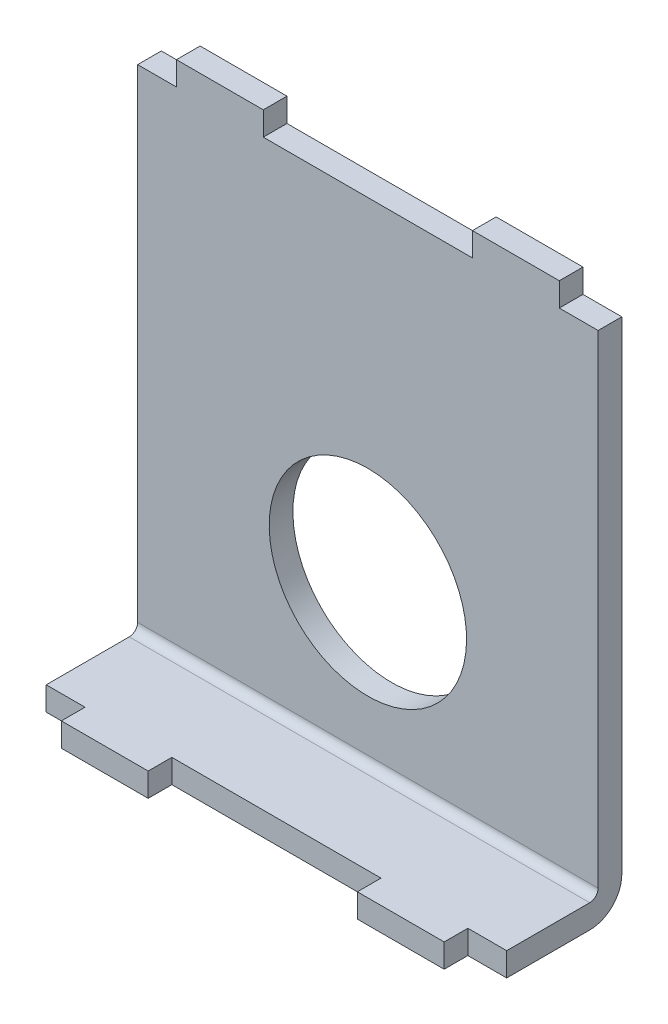
ISO-10303-21;
HEADER;
FILE_DESCRIPTION(('STEP AP214'),'2;1');
FILE_NAME('part.step','',(''),(''),'','','');
FILE_SCHEMA(('AUTOMOTIVE_DESIGN { 1 0 10303 214 1 1 1 1 }'));
ENDSEC;
DATA;
#1=APPLICATION_CONTEXT('core data for automotive mechanical design processes');
#2=APPLICATION_PROTOCOL_DEFINITION('international standard','automotive_design',2000,#1);
#3=PRODUCT_CONTEXT('',#1,'mechanical');
#4=PRODUCT('Part','Part','',(#3));
#5=PRODUCT_RELATED_PRODUCT_CATEGORY('part','',(#4));
#6=PRODUCT_DEFINITION_FORMATION('','',#4);
#7=PRODUCT_DEFINITION_CONTEXT('part definition',#1,'design');
#8=PRODUCT_DEFINITION('design','',#6,#7);
#9=PRODUCT_DEFINITION_SHAPE('','',#8);
#10=(LENGTH_UNIT() NAMED_UNIT(*) SI_UNIT(.MILLI.,.METRE.));
#11=(NAMED_UNIT(*) PLANE_ANGLE_UNIT() SI_UNIT($,.RADIAN.));
#12=(NAMED_UNIT(*) SI_UNIT($,.STERADIAN.) SOLID_ANGLE_UNIT());
#13=UNCERTAINTY_MEASURE_WITH_UNIT(LENGTH_MEASURE(1.E-05),#10,'distance_accuracy_value','');
#14=(GEOMETRIC_REPRESENTATION_CONTEXT(3) GLOBAL_UNCERTAINTY_ASSIGNED_CONTEXT((#13)) GLOBAL_UNIT_ASSIGNED_CONTEXT((#10,
#11,#12)) REPRESENTATION_CONTEXT('',''));
#15=CARTESIAN_POINT('',(0.,0.,0.));
#16=DIRECTION('',(0.,0.,1.));
#17=DIRECTION('',(1.,0.,0.));
#18=AXIS2_PLACEMENT_3D('',#15,#16,#17);
#19=CARTESIAN_POINT('',(0.,-24.86025,-1.02348685082632E-13));
#20=DIRECTION('',(0.,1.,0.));
#21=DIRECTION('',(0.,0.,1.));
#22=AXIS2_PLACEMENT_3D('',#19,#20,#21);
#23=PLANE('',#22);
#24=DIRECTION('',(0.,0.,1.));
#25=VECTOR('',#24,1.);
#26=CARTESIAN_POINT('',(22.225,-24.86025,11.1125));
#27=LINE('',#26,#25);
#28=CARTESIAN_POINT('',(22.225,-24.86025,3.09879999999998));
#29=VERTEX_POINT('',#28);
#30=CARTESIAN_POINT('',(22.225,-24.86025,11.1125));
#31=VERTEX_POINT('',#30);
#32=EDGE_CURVE('E222',#29,#31,#27,.T.);
#33=ORIENTED_EDGE('',*,*,#32,.T.);
#34=DIRECTION('',(1.,0.,0.));
#35=VECTOR('',#34,1.);
#36=CARTESIAN_POINT('',(-22.225,-24.86025,11.1125));
#37=LINE('',#36,#35);
#38=CARTESIAN_POINT('',(18.4785,-24.86025,11.1125));
#39=VERTEX_POINT('',#38);
#40=EDGE_CURVE('E255',#31,#39,#37,.F.);
#41=ORIENTED_EDGE('',*,*,#40,.T.);
#42=DIRECTION('',(0.,0.,1.));
#43=VECTOR('',#42,1.);
#44=CARTESIAN_POINT('',(18.4785,-24.86025,11.1125));
#45=LINE('',#44,#43);
#46=CARTESIAN_POINT('',(18.4785,-24.86025,13.3985));
#47=VERTEX_POINT('',#46);
#48=EDGE_CURVE('E265',#47,#39,#45,.F.);
#49=ORIENTED_EDGE('',*,*,#48,.F.);
#50=DIRECTION('',(1.,0.,0.));
#51=VECTOR('',#50,1.);
#52=CARTESIAN_POINT('',(18.4785,-24.86025,13.3985));
#53=LINE('',#52,#51);
#54=CARTESIAN_POINT('',(10.0965,-24.86025,13.3985));
#55=VERTEX_POINT('',#54);
#56=EDGE_CURVE('E274',#55,#47,#53,.T.);
#57=ORIENTED_EDGE('',*,*,#56,.F.);
#58=DIRECTION('',(0.,0.,1.));
#59=VECTOR('',#58,1.);
#60=CARTESIAN_POINT('',(10.0965,-24.86025,13.3985));
#61=LINE('',#60,#59);
#62=CARTESIAN_POINT('',(10.0965,-24.86025,11.1125));
#63=VERTEX_POINT('',#62);
#64=EDGE_CURVE('E284',#63,#55,#61,.T.);
#65=ORIENTED_EDGE('',*,*,#64,.F.);
#66=DIRECTION('',(1.,0.,0.));
#67=VECTOR('',#66,1.);
#68=CARTESIAN_POINT('',(-22.225,-24.86025,11.1125));
#69=LINE('',#68,#67);
#70=CARTESIAN_POINT('',(-10.0965,-24.86025,11.1125));
#71=VERTEX_POINT('',#70);
#72=EDGE_CURVE('E294',#63,#71,#69,.F.);
#73=ORIENTED_EDGE('',*,*,#72,.T.);
#74=DIRECTION('',(0.,0.,-1.));
#75=VECTOR('',#74,1.);
#76=CARTESIAN_POINT('',(-10.0965,-24.86025,13.3985));
#77=LINE('',#76,#75);
#78=CARTESIAN_POINT('',(-10.0965,-24.86025,13.3985));
#79=VERTEX_POINT('',#78);
#80=EDGE_CURVE('E303',#79,#71,#77,.T.);
#81=ORIENTED_EDGE('',*,*,#80,.F.);
#82=DIRECTION('',(1.,0.,0.));
#83=VECTOR('',#82,1.);
#84=CARTESIAN_POINT('',(-18.4785,-24.86025,13.3985));
#85=LINE('',#84,#83);
#86=CARTESIAN_POINT('',(-18.4785,-24.86025,13.3985));
#87=VERTEX_POINT('',#86);
#88=EDGE_CURVE('E312',#87,#79,#85,.T.);
#89=ORIENTED_EDGE('',*,*,#88,.F.);
#90=DIRECTION('',(0.,0.,1.));
#91=VECTOR('',#90,1.);
#92=CARTESIAN_POINT('',(-18.4785,-24.86025,11.1125));
#93=LINE('',#92,#91);
#94=CARTESIAN_POINT('',(-18.4785,-24.86025,11.1125));
#95=VERTEX_POINT('',#94);
#96=EDGE_CURVE('E262',#95,#87,#93,.T.);
#97=ORIENTED_EDGE('',*,*,#96,.F.);
#98=DIRECTION('',(1.,0.,0.));
#99=VECTOR('',#98,1.);
#100=CARTESIAN_POINT('',(-22.225,-24.86025,11.1125));
#101=LINE('',#100,#99);
#102=CARTESIAN_POINT('',(-22.225,-24.86025,11.1125));
#103=VERTEX_POINT('',#102);
#104=EDGE_CURVE('E260',#95,#103,#101,.F.);
#105=ORIENTED_EDGE('',*,*,#104,.T.);
#106=DIRECTION('',(0.,0.,1.));
#107=VECTOR('',#106,1.);
#108=CARTESIAN_POINT('',(-22.225,-24.86025,2.28599999999998));
#109=LINE('',#108,#107);
#110=CARTESIAN_POINT('',(-22.225,-24.86025,3.09879999999998));
#111=VERTEX_POINT('',#110);
#112=EDGE_CURVE('E225',#103,#111,#109,.F.);
#113=ORIENTED_EDGE('',*,*,#112,.T.);
#114=DIRECTION('',(1.,0.,0.));
#115=VECTOR('',#114,1.);
#116=CARTESIAN_POINT('',(22.225,-24.86025,3.09879999999998));
#117=LINE('',#116,#115);
#118=EDGE_CURVE('E182',#29,#111,#117,.F.);
#119=ORIENTED_EDGE('',*,*,#118,.F.);
#120=EDGE_LOOP('',(#33,#41,#49,#57,#65,#73,#81,#89,#97,#105,#113,#119));
#121=FACE_BOUND('',#120,.T.);
#122=ADVANCED_FACE('F18',(#121),#23,.F.);
#123=CARTESIAN_POINT('',(-22.225,-24.86025,11.1125));
#124=DIRECTION('',(0.,0.,-1.));
#125=DIRECTION('',(0.,1.,0.));
#126=AXIS2_PLACEMENT_3D('',#123,#124,#125);
#127=PLANE('',#126);
#128=DIRECTION('',(0.,-1.,0.));
#129=VECTOR('',#128,1.);
#130=CARTESIAN_POINT('',(-18.4785,-22.57425,11.1125));
#131=LINE('',#130,#129);
#132=CARTESIAN_POINT('',(-18.4785,-22.57425,11.1125));
#133=VERTEX_POINT('',#132);
#134=EDGE_CURVE('E315',#133,#95,#131,.T.);
#135=ORIENTED_EDGE('',*,*,#134,.F.);
#136=DIRECTION('',(1.,0.,0.));
#137=VECTOR('',#136,1.);
#138=CARTESIAN_POINT('',(0.,-22.57425,11.1125));
#139=LINE('',#138,#137);
#140=CARTESIAN_POINT('',(-22.225,-22.57425,11.1125));
#141=VERTEX_POINT('',#140);
#142=EDGE_CURVE('E240',#141,#133,#139,.T.);
#143=ORIENTED_EDGE('',*,*,#142,.F.);
#144=DIRECTION('',(0.,1.,0.));
#145=VECTOR('',#144,1.);
#146=CARTESIAN_POINT('',(-22.225,-24.86025,11.1125));
#147=LINE('',#146,#145);
#148=EDGE_CURVE('E232',#141,#103,#147,.F.);
#149=ORIENTED_EDGE('',*,*,#148,.T.);
#150=ORIENTED_EDGE('',*,*,#104,.F.);
#151=EDGE_LOOP('',(#135,#143,#149,#150));
#152=FACE_BOUND('',#151,.T.);
#153=ADVANCED_FACE('F387',(#152),#127,.F.);
#154=CARTESIAN_POINT('',(-18.4785,-22.57425,11.1125));
#155=DIRECTION('',(-1.,0.,0.));
#156=DIRECTION('',(0.,-1.,0.));
#157=AXIS2_PLACEMENT_3D('',#154,#155,#156);
#158=PLANE('',#157);
#159=DIRECTION('',(0.,0.,1.));
#160=VECTOR('',#159,1.);
#161=CARTESIAN_POINT('',(-18.4785,-22.57425,0.));
#162=LINE('',#161,#160);
#163=CARTESIAN_POINT('',(-18.4785,-22.57425,13.3985));
#164=VERTEX_POINT('',#163);
#165=EDGE_CURVE('E243',#133,#164,#162,.T.);
#166=ORIENTED_EDGE('',*,*,#165,.F.);
#167=ORIENTED_EDGE('',*,*,#134,.T.);
#168=ORIENTED_EDGE('',*,*,#96,.T.);
#169=DIRECTION('',(0.,-1.,0.));
#170=VECTOR('',#169,1.);
#171=CARTESIAN_POINT('',(-18.4785,-22.57425,13.3985));
#172=LINE('',#171,#170);
#173=EDGE_CURVE('E306',#164,#87,#172,.T.);
#174=ORIENTED_EDGE('',*,*,#173,.F.);
#175=EDGE_LOOP('',(#166,#167,#168,#174));
#176=FACE_BOUND('',#175,.T.);
#177=ADVANCED_FACE('F384',(#176),#158,.T.);
#178=CARTESIAN_POINT('',(-18.4785,-22.57425,13.3985));
#179=DIRECTION('',(0.,0.,1.));
#180=DIRECTION('',(0.,-1.,0.));
#181=AXIS2_PLACEMENT_3D('',#178,#179,#180);
#182=PLANE('',#181);
#183=DIRECTION('',(1.,0.,0.));
#184=VECTOR('',#183,1.);
#185=CARTESIAN_POINT('',(0.,-22.57425,13.3985));
#186=LINE('',#185,#184);
#187=CARTESIAN_POINT('',(-10.0965,-22.57425,13.3985));
#188=VERTEX_POINT('',#187);
#189=EDGE_CURVE('E380',#164,#188,#186,.T.);
#190=ORIENTED_EDGE('',*,*,#189,.F.);
#191=ORIENTED_EDGE('',*,*,#173,.T.);
#192=ORIENTED_EDGE('',*,*,#88,.T.);
#193=DIRECTION('',(0.,1.,0.));
#194=VECTOR('',#193,1.);
#195=CARTESIAN_POINT('',(-10.0965,-22.57425,13.3985));
#196=LINE('',#195,#194);
#197=EDGE_CURVE('E296',#188,#79,#196,.F.);
#198=ORIENTED_EDGE('',*,*,#197,.F.);
#199=EDGE_LOOP('',(#190,#191,#192,#198));
#200=FACE_BOUND('',#199,.T.);
#201=ADVANCED_FACE('F379',(#200),#182,.T.);
#202=CARTESIAN_POINT('',(-10.0965,-22.57425,13.3985));
#203=DIRECTION('',(1.,0.,0.));
#204=DIRECTION('',(0.,0.,-1.));
#205=AXIS2_PLACEMENT_3D('',#202,#203,#204);
#206=PLANE('',#205);
#207=DIRECTION('',(0.,0.,1.));
#208=VECTOR('',#207,1.);
#209=CARTESIAN_POINT('',(-10.0965,-22.57425,0.));
#210=LINE('',#209,#208);
#211=CARTESIAN_POINT('',(-10.0965,-22.57425,11.1125));
#212=VERTEX_POINT('',#211);
#213=EDGE_CURVE('E375',#188,#212,#210,.F.);
#214=ORIENTED_EDGE('',*,*,#213,.F.);
#215=ORIENTED_EDGE('',*,*,#197,.T.);
#216=ORIENTED_EDGE('',*,*,#80,.T.);
#217=DIRECTION('',(0.,1.,0.));
#218=VECTOR('',#217,1.);
#219=CARTESIAN_POINT('',(-10.0965,-24.86025,11.1125));
#220=LINE('',#219,#218);
#221=EDGE_CURVE('E287',#71,#212,#220,.T.);
#222=ORIENTED_EDGE('',*,*,#221,.T.);
#223=EDGE_LOOP('',(#214,#215,#216,#222));
#224=FACE_BOUND('',#223,.T.);
#225=ADVANCED_FACE('F374',(#224),#206,.T.);
#226=CARTESIAN_POINT('',(-22.225,-24.86025,11.1125));
#227=DIRECTION('',(0.,0.,-1.));
#228=DIRECTION('',(0.,1.,0.));
#229=AXIS2_PLACEMENT_3D('',#226,#227,#228);
#230=PLANE('',#229);
#231=ORIENTED_EDGE('',*,*,#221,.F.);
#232=ORIENTED_EDGE('',*,*,#72,.F.);
#233=DIRECTION('',(0.,-1.,0.));
#234=VECTOR('',#233,1.);
#235=CARTESIAN_POINT('',(10.0965,-22.57425,11.1125));
#236=LINE('',#235,#234);
#237=CARTESIAN_POINT('',(10.0965,-22.57425,11.1125));
#238=VERTEX_POINT('',#237);
#239=EDGE_CURVE('E277',#238,#63,#236,.T.);
#240=ORIENTED_EDGE('',*,*,#239,.F.);
#241=DIRECTION('',(1.,0.,0.));
#242=VECTOR('',#241,1.);
#243=CARTESIAN_POINT('',(0.,-22.57425,11.1125));
#244=LINE('',#243,#242);
#245=EDGE_CURVE('E370',#212,#238,#244,.T.);
#246=ORIENTED_EDGE('',*,*,#245,.F.);
#247=EDGE_LOOP('',(#231,#232,#240,#246));
#248=FACE_BOUND('',#247,.T.);
#249=ADVANCED_FACE('F368',(#248),#230,.F.);
#250=CARTESIAN_POINT('',(10.0965,-22.57425,13.3985));
#251=DIRECTION('',(-1.,0.,0.));
#252=DIRECTION('',(0.,-1.,0.));
#253=AXIS2_PLACEMENT_3D('',#250,#251,#252);
#254=PLANE('',#253);
#255=DIRECTION('',(0.,0.,1.));
#256=VECTOR('',#255,1.);
#257=CARTESIAN_POINT('',(10.0965,-22.57425,0.));
#258=LINE('',#257,#256);
#259=CARTESIAN_POINT('',(10.0965,-22.57425,13.3985));
#260=VERTEX_POINT('',#259);
#261=EDGE_CURVE('E363',#238,#260,#258,.T.);
#262=ORIENTED_EDGE('',*,*,#261,.F.);
#263=ORIENTED_EDGE('',*,*,#239,.T.);
#264=ORIENTED_EDGE('',*,*,#64,.T.);
#265=DIRECTION('',(0.,-1.,0.));
#266=VECTOR('',#265,1.);
#267=CARTESIAN_POINT('',(10.0965,-22.57425,13.3985));
#268=LINE('',#267,#266);
#269=EDGE_CURVE('E268',#260,#55,#268,.T.);
#270=ORIENTED_EDGE('',*,*,#269,.F.);
#271=EDGE_LOOP('',(#262,#263,#264,#270));
#272=FACE_BOUND('',#271,.T.);
#273=ADVANCED_FACE('F362',(#272),#254,.T.);
#274=CARTESIAN_POINT('',(18.4785,-22.57425,13.3985));
#275=DIRECTION('',(0.,0.,1.));
#276=DIRECTION('',(0.,-1.,0.));
#277=AXIS2_PLACEMENT_3D('',#274,#275,#276);
#278=PLANE('',#277);
#279=DIRECTION('',(1.,0.,0.));
#280=VECTOR('',#279,1.);
#281=CARTESIAN_POINT('',(0.,-22.57425,13.3985));
#282=LINE('',#281,#280);
#283=CARTESIAN_POINT('',(18.4785,-22.57425,13.3985));
#284=VERTEX_POINT('',#283);
#285=EDGE_CURVE('E358',#260,#284,#282,.T.);
#286=ORIENTED_EDGE('',*,*,#285,.F.);
#287=ORIENTED_EDGE('',*,*,#269,.T.);
#288=ORIENTED_EDGE('',*,*,#56,.T.);
#289=DIRECTION('',(0.,1.,0.));
#290=VECTOR('',#289,1.);
#291=CARTESIAN_POINT('',(18.4785,-22.57425,13.3985));
#292=LINE('',#291,#290);
#293=EDGE_CURVE('E257',#284,#47,#292,.F.);
#294=ORIENTED_EDGE('',*,*,#293,.F.);
#295=EDGE_LOOP('',(#286,#287,#288,#294));
#296=FACE_BOUND('',#295,.T.);
#297=ADVANCED_FACE('F357',(#296),#278,.T.);
#298=CARTESIAN_POINT('',(18.4785,-22.57425,11.1125));
#299=DIRECTION('',(1.,0.,0.));
#300=DIRECTION('',(0.,1.,0.));
#301=AXIS2_PLACEMENT_3D('',#298,#299,#300);
#302=PLANE('',#301);
#303=DIRECTION('',(0.,0.,1.));
#304=VECTOR('',#303,1.);
#305=CARTESIAN_POINT('',(18.4785,-22.57425,0.));
#306=LINE('',#305,#304);
#307=CARTESIAN_POINT('',(18.4785,-22.57425,11.1125));
#308=VERTEX_POINT('',#307);
#309=EDGE_CURVE('E252',#284,#308,#306,.F.);
#310=ORIENTED_EDGE('',*,*,#309,.F.);
#311=ORIENTED_EDGE('',*,*,#293,.T.);
#312=ORIENTED_EDGE('',*,*,#48,.T.);
#313=DIRECTION('',(0.,1.,0.));
#314=VECTOR('',#313,1.);
#315=CARTESIAN_POINT('',(18.4785,-24.86025,11.1125));
#316=LINE('',#315,#314);
#317=EDGE_CURVE('E237',#39,#308,#316,.T.);
#318=ORIENTED_EDGE('',*,*,#317,.T.);
#319=EDGE_LOOP('',(#310,#311,#312,#318));
#320=FACE_BOUND('',#319,.T.);
#321=ADVANCED_FACE('F353',(#320),#302,.T.);
#322=CARTESIAN_POINT('',(-22.225,-24.86025,11.1125));
#323=DIRECTION('',(0.,0.,-1.));
#324=DIRECTION('',(0.,1.,0.));
#325=AXIS2_PLACEMENT_3D('',#322,#323,#324);
#326=PLANE('',#325);
#327=ORIENTED_EDGE('',*,*,#317,.F.);
#328=ORIENTED_EDGE('',*,*,#40,.F.);
#329=DIRECTION('',(0.,-1.,0.));
#330=VECTOR('',#329,1.);
#331=CARTESIAN_POINT('',(22.225,-24.86025,11.1125));
#332=LINE('',#331,#330);
#333=CARTESIAN_POINT('',(22.225,-22.57425,11.1125));
#334=VERTEX_POINT('',#333);
#335=EDGE_CURVE('E224',#31,#334,#332,.F.);
#336=ORIENTED_EDGE('',*,*,#335,.T.);
#337=DIRECTION('',(1.,0.,0.));
#338=VECTOR('',#337,1.);
#339=CARTESIAN_POINT('',(0.,-22.57425,11.1125));
#340=LINE('',#339,#338);
#341=EDGE_CURVE('E187',#308,#334,#340,.T.);
#342=ORIENTED_EDGE('',*,*,#341,.F.);
#343=EDGE_LOOP('',(#327,#328,#336,#342));
#344=FACE_BOUND('',#343,.T.);
#345=ADVANCED_FACE('F348',(#344),#326,.F.);
#346=CARTESIAN_POINT('',(22.225,-21.76145,3.09879999999999));
#347=DIRECTION('',(1.,0.,0.));
#348=DIRECTION('',(0.,1.,0.));
#349=AXIS2_PLACEMENT_3D('',#346,#347,#348);
#350=CYLINDRICAL_SURFACE('',#349,3.0988);
#351=ORIENTED_EDGE('',*,*,#118,.T.);
#352=CARTESIAN_POINT('',(-22.225,-21.76145,3.09879999999999));
#353=DIRECTION('',(1.,0.,0.));
#354=DIRECTION('',(0.,1.,0.));
#355=AXIS2_PLACEMENT_3D('',#352,#353,#354);
#356=CIRCLE('',#355,3.0988);
#357=CARTESIAN_POINT('',(-22.225,-21.76145,0.));
#358=VERTEX_POINT('',#357);
#359=EDGE_CURVE('E21',#358,#111,#356,.F.);
#360=ORIENTED_EDGE('',*,*,#359,.F.);
#361=DIRECTION('',(1.,0.,0.));
#362=VECTOR('',#361,1.);
#363=CARTESIAN_POINT('',(-22.225,-21.76145,0.));
#364=LINE('',#363,#362);
#365=CARTESIAN_POINT('',(22.225,-21.76145,0.));
#366=VERTEX_POINT('',#365);
#367=EDGE_CURVE('E180',#358,#366,#364,.T.);
#368=ORIENTED_EDGE('',*,*,#367,.T.);
#369=CARTESIAN_POINT('',(22.225,-21.76145,3.09879999999999));
#370=DIRECTION('',(1.,0.,0.));
#371=DIRECTION('',(0.,1.,0.));
#372=AXIS2_PLACEMENT_3D('',#369,#370,#371);
#373=CIRCLE('',#372,3.0988);
#374=EDGE_CURVE('E186',#366,#29,#373,.F.);
#375=ORIENTED_EDGE('',*,*,#374,.T.);
#376=EDGE_LOOP('',(#351,#360,#368,#375));
#377=FACE_BOUND('',#376,.T.);
#378=ADVANCED_FACE('F178',(#377),#350,.T.);
#379=CARTESIAN_POINT('',(0.,-22.57425,0.));
#380=DIRECTION('',(0.,1.,0.));
#381=DIRECTION('',(0.,0.,1.));
#382=AXIS2_PLACEMENT_3D('',#379,#380,#381);
#383=PLANE('',#382);
#384=ORIENTED_EDGE('',*,*,#309,.T.);
#385=ORIENTED_EDGE('',*,*,#341,.T.);
#386=DIRECTION('',(0.,0.,1.));
#387=VECTOR('',#386,1.);
#388=CARTESIAN_POINT('',(22.225,-22.57425,0.));
#389=LINE('',#388,#387);
#390=CARTESIAN_POINT('',(22.225,-22.57425,3.09879999999998));
#391=VERTEX_POINT('',#390);
#392=EDGE_CURVE('E229',#334,#391,#389,.F.);
#393=ORIENTED_EDGE('',*,*,#392,.T.);
#394=DIRECTION('',(1.,0.,0.));
#395=VECTOR('',#394,1.);
#396=CARTESIAN_POINT('',(22.225,-22.57425,3.09879999999998));
#397=LINE('',#396,#395);
#398=CARTESIAN_POINT('',(-22.225,-22.57425,3.09879999999998));
#399=VERTEX_POINT('',#398);
#400=EDGE_CURVE('E204',#391,#399,#397,.F.);
#401=ORIENTED_EDGE('',*,*,#400,.T.);
#402=DIRECTION('',(0.,0.,1.));
#403=VECTOR('',#402,1.);
#404=CARTESIAN_POINT('',(-22.225,-22.57425,0.));
#405=LINE('',#404,#403);
#406=EDGE_CURVE('E244',#399,#141,#405,.T.);
#407=ORIENTED_EDGE('',*,*,#406,.T.);
#408=ORIENTED_EDGE('',*,*,#142,.T.);
#409=ORIENTED_EDGE('',*,*,#165,.T.);
#410=ORIENTED_EDGE('',*,*,#189,.T.);
#411=ORIENTED_EDGE('',*,*,#213,.T.);
#412=ORIENTED_EDGE('',*,*,#245,.T.);
#413=ORIENTED_EDGE('',*,*,#261,.T.);
#414=ORIENTED_EDGE('',*,*,#285,.T.);
#415=EDGE_LOOP('',(#384,#385,#393,#401,#407,#408,#409,#410,#411,#412,#413,#414));
#416=FACE_BOUND('',#415,.T.);
#417=ADVANCED_FACE('F397',(#416),#383,.T.);
#418=CARTESIAN_POINT('',(-22.225,-24.86025,0.));
#419=DIRECTION('',(0.,0.,1.));
#420=DIRECTION('',(0.,-1.,0.));
#421=AXIS2_PLACEMENT_3D('',#418,#419,#420);
#422=PLANE('',#421);
#423=DIRECTION('',(0.,1.,0.));
#424=VECTOR('',#423,1.);
#425=CARTESIAN_POINT('',(-22.225,24.86025,0.));
#426=LINE('',#425,#424);
#427=CARTESIAN_POINT('',(-22.225,24.86025,0.));
#428=VERTEX_POINT('',#427);
#429=EDGE_CURVE('E191',#358,#428,#426,.T.);
#430=ORIENTED_EDGE('',*,*,#429,.T.);
#431=DIRECTION('',(1.,0.,0.));
#432=VECTOR('',#431,1.);
#433=CARTESIAN_POINT('',(-22.225,24.86025,0.));
#434=LINE('',#433,#432);
#435=CARTESIAN_POINT('',(-18.4785,24.86025,0.));
#436=VERTEX_POINT('',#435);
#437=EDGE_CURVE('E215',#428,#436,#434,.T.);
#438=ORIENTED_EDGE('',*,*,#437,.T.);
#439=DIRECTION('',(0.,-1.,0.));
#440=VECTOR('',#439,1.);
#441=CARTESIAN_POINT('',(-18.4785,24.86025,0.));
#442=LINE('',#441,#440);
#443=CARTESIAN_POINT('',(-18.4785,27.14625,0.));
#444=VERTEX_POINT('',#443);
#445=EDGE_CURVE('E470',#444,#436,#442,.T.);
#446=ORIENTED_EDGE('',*,*,#445,.F.);
#447=DIRECTION('',(1.,0.,0.));
#448=VECTOR('',#447,1.);
#449=CARTESIAN_POINT('',(-18.4785,27.14625,0.));
#450=LINE('',#449,#448);
#451=CARTESIAN_POINT('',(-10.0965,27.14625,0.));
#452=VERTEX_POINT('',#451);
#453=EDGE_CURVE('E464',#452,#444,#450,.F.);
#454=ORIENTED_EDGE('',*,*,#453,.F.);
#455=DIRECTION('',(0.,1.,0.));
#456=VECTOR('',#455,1.);
#457=CARTESIAN_POINT('',(-10.0965,24.86025,0.));
#458=LINE('',#457,#456);
#459=CARTESIAN_POINT('',(-10.0965,24.86025,0.));
#460=VERTEX_POINT('',#459);
#461=EDGE_CURVE('E458',#460,#452,#458,.T.);
#462=ORIENTED_EDGE('',*,*,#461,.F.);
#463=DIRECTION('',(1.,0.,0.));
#464=VECTOR('',#463,1.);
#465=CARTESIAN_POINT('',(-22.225,24.86025,0.));
#466=LINE('',#465,#464);
#467=CARTESIAN_POINT('',(10.0965,24.86025,0.));
#468=VERTEX_POINT('',#467);
#469=EDGE_CURVE('E454',#460,#468,#466,.T.);
#470=ORIENTED_EDGE('',*,*,#469,.T.);
#471=DIRECTION('',(0.,-1.,0.));
#472=VECTOR('',#471,1.);
#473=CARTESIAN_POINT('',(10.0965,24.86025,0.));
#474=LINE('',#473,#472);
#475=CARTESIAN_POINT('',(10.0965,27.14625,0.));
#476=VERTEX_POINT('',#475);
#477=EDGE_CURVE('E448',#476,#468,#474,.T.);
#478=ORIENTED_EDGE('',*,*,#477,.F.);
#479=DIRECTION('',(-1.,0.,0.));
#480=VECTOR('',#479,1.);
#481=CARTESIAN_POINT('',(10.0965,27.14625,0.));
#482=LINE('',#481,#480);
#483=CARTESIAN_POINT('',(18.4785,27.14625,0.));
#484=VERTEX_POINT('',#483);
#485=EDGE_CURVE('E442',#484,#476,#482,.T.);
#486=ORIENTED_EDGE('',*,*,#485,.F.);
#487=DIRECTION('',(0.,1.,0.));
#488=VECTOR('',#487,1.);
#489=CARTESIAN_POINT('',(18.4785,24.86025,0.));
#490=LINE('',#489,#488);
#491=CARTESIAN_POINT('',(18.4785,24.86025,0.));
#492=VERTEX_POINT('',#491);
#493=EDGE_CURVE('E430',#492,#484,#490,.T.);
#494=ORIENTED_EDGE('',*,*,#493,.F.);
#495=DIRECTION('',(1.,0.,0.));
#496=VECTOR('',#495,1.);
#497=CARTESIAN_POINT('',(-22.225,24.86025,0.));
#498=LINE('',#497,#496);
#499=CARTESIAN_POINT('',(22.225,24.86025,0.));
#500=VERTEX_POINT('',#499);
#501=EDGE_CURVE('E427',#492,#500,#498,.T.);
#502=ORIENTED_EDGE('',*,*,#501,.T.);
#503=DIRECTION('',(0.,-1.,0.));
#504=VECTOR('',#503,1.);
#505=CARTESIAN_POINT('',(22.225,24.86025,0.));
#506=LINE('',#505,#504);
#507=EDGE_CURVE('E194',#500,#366,#506,.T.);
#508=ORIENTED_EDGE('',*,*,#507,.T.);
#509=ORIENTED_EDGE('',*,*,#367,.F.);
#510=EDGE_LOOP('',(#430,#438,#446,#454,#462,#470,#478,#486,#494,#502,#508,#509));
#511=FACE_BOUND('',#510,.T.);
#512=CARTESIAN_POINT('',(0.,-7.30250000000003,0.));
#513=DIRECTION('',(0.,0.,-1.));
#514=DIRECTION('',(0.,1.,0.));
#515=AXIS2_PLACEMENT_3D('',#512,#513,#514);
#516=CIRCLE('',#515,9.525);
#517=CARTESIAN_POINT('',(0.,2.22249999999997,0.));
#518=VERTEX_POINT('',#517);
#519=EDGE_CURVE('E196',#518,#518,#516,.F.);
#520=ORIENTED_EDGE('',*,*,#519,.T.);
#521=EDGE_LOOP('',(#520));
#522=FACE_BOUND('',#521,.T.);
#523=ADVANCED_FACE('F189',(#511,#522),#422,.F.);
#524=CARTESIAN_POINT('',(0.,-7.30250000000003,13.398525));
#525=DIRECTION('',(0.,0.,-1.));
#526=DIRECTION('',(0.,1.,0.));
#527=AXIS2_PLACEMENT_3D('',#524,#525,#526);
#528=CYLINDRICAL_SURFACE('',#527,9.525);
#529=CARTESIAN_POINT('',(0.,-7.30250000000003,2.286));
#530=DIRECTION('',(0.,0.,-1.));
#531=DIRECTION('',(0.,1.,0.));
#532=AXIS2_PLACEMENT_3D('',#529,#530,#531);
#533=CIRCLE('',#532,9.525);
#534=CARTESIAN_POINT('',(0.,2.22249999999997,2.286));
#535=VERTEX_POINT('',#534);
#536=EDGE_CURVE('E334',#535,#535,#533,.T.);
#537=ORIENTED_EDGE('',*,*,#536,.F.);
#538=EDGE_LOOP('',(#537));
#539=FACE_BOUND('',#538,.T.);
#540=ORIENTED_EDGE('',*,*,#519,.F.);
#541=EDGE_LOOP('',(#540));
#542=FACE_BOUND('',#541,.T.);
#543=ADVANCED_FACE('F605',(#539,#542),#528,.F.);
#544=CARTESIAN_POINT('',(-22.225,24.86025,2.286));
#545=DIRECTION('',(1.,0.,0.));
#546=DIRECTION('',(0.,1.,0.));
#547=AXIS2_PLACEMENT_3D('',#544,#545,#546);
#548=PLANE('',#547);
#549=DIRECTION('',(0.,-1.,0.));
#550=VECTOR('',#549,1.);
#551=CARTESIAN_POINT('',(-22.225,-24.86025,2.28599999999999));
#552=LINE('',#551,#550);
#553=CARTESIAN_POINT('',(-22.225,24.86025,2.286));
#554=VERTEX_POINT('',#553);
#555=CARTESIAN_POINT('',(-22.225,-21.76145,2.28599999999999));
#556=VERTEX_POINT('',#555);
#557=EDGE_CURVE('E337',#554,#556,#552,.T.);
#558=ORIENTED_EDGE('',*,*,#557,.F.);
#559=DIRECTION('',(0.,0.,-1.));
#560=VECTOR('',#559,1.);
#561=CARTESIAN_POINT('',(-22.225,24.86025,2.286));
#562=LINE('',#561,#560);
#563=EDGE_CURVE('E200',#554,#428,#562,.T.);
#564=ORIENTED_EDGE('',*,*,#563,.T.);
#565=ORIENTED_EDGE('',*,*,#429,.F.);
#566=ORIENTED_EDGE('',*,*,#359,.T.);
#567=ORIENTED_EDGE('',*,*,#112,.F.);
#568=ORIENTED_EDGE('',*,*,#148,.F.);
#569=ORIENTED_EDGE('',*,*,#406,.F.);
#570=CARTESIAN_POINT('',(-22.225,-21.76145,3.09879999999999));
#571=DIRECTION('',(1.,0.,0.));
#572=DIRECTION('',(0.,1.,0.));
#573=AXIS2_PLACEMENT_3D('',#570,#571,#572);
#574=CIRCLE('',#573,0.812799999999999);
#575=EDGE_CURVE('E338',#399,#556,#574,.T.);
#576=ORIENTED_EDGE('',*,*,#575,.T.);
#577=EDGE_LOOP('',(#558,#564,#565,#566,#567,#568,#569,#576));
#578=FACE_BOUND('',#577,.T.);
#579=ADVANCED_FACE('F198',(#578),#548,.F.);
#580=CARTESIAN_POINT('',(22.225,-21.76145,3.09879999999999));
#581=DIRECTION('',(1.,0.,0.));
#582=DIRECTION('',(0.,1.,0.));
#583=AXIS2_PLACEMENT_3D('',#580,#581,#582);
#584=CYLINDRICAL_SURFACE('',#583,0.812799999999999);
#585=ORIENTED_EDGE('',*,*,#575,.F.);
#586=ORIENTED_EDGE('',*,*,#400,.F.);
#587=CARTESIAN_POINT('',(22.225,-21.76145,3.09879999999999));
#588=DIRECTION('',(1.,0.,0.));
#589=DIRECTION('',(0.,1.,0.));
#590=AXIS2_PLACEMENT_3D('',#587,#588,#589);
#591=CIRCLE('',#590,0.812799999999999);
#592=CARTESIAN_POINT('',(22.225,-21.76145,2.28599999999999));
#593=VERTEX_POINT('',#592);
#594=EDGE_CURVE('E202',#593,#391,#591,.F.);
#595=ORIENTED_EDGE('',*,*,#594,.F.);
#596=DIRECTION('',(1.,0.,0.));
#597=VECTOR('',#596,1.);
#598=CARTESIAN_POINT('',(-22.225,-21.76145,2.28599999999999));
#599=LINE('',#598,#597);
#600=EDGE_CURVE('E402',#556,#593,#599,.T.);
#601=ORIENTED_EDGE('',*,*,#600,.F.);
#602=EDGE_LOOP('',(#585,#586,#595,#601));
#603=FACE_BOUND('',#602,.T.);
#604=ADVANCED_FACE('F400',(#603),#584,.F.);
#605=CARTESIAN_POINT('',(22.225,24.86025,2.286));
#606=DIRECTION('',(-1.,0.,0.));
#607=DIRECTION('',(0.,-1.,0.));
#608=AXIS2_PLACEMENT_3D('',#605,#606,#607);
#609=PLANE('',#608);
#610=ORIENTED_EDGE('',*,*,#507,.F.);
#611=DIRECTION('',(0.,0.,-1.));
#612=VECTOR('',#611,1.);
#613=CARTESIAN_POINT('',(22.225,24.86025,2.286));
#614=LINE('',#613,#612);
#615=CARTESIAN_POINT('',(22.225,24.86025,2.28599999999999));
#616=VERTEX_POINT('',#615);
#617=EDGE_CURVE('E425',#500,#616,#614,.F.);
#618=ORIENTED_EDGE('',*,*,#617,.T.);
#619=DIRECTION('',(0.,-1.,0.));
#620=VECTOR('',#619,1.);
#621=CARTESIAN_POINT('',(22.225,-24.86025,2.28599999999999));
#622=LINE('',#621,#620);
#623=EDGE_CURVE('E407',#593,#616,#622,.F.);
#624=ORIENTED_EDGE('',*,*,#623,.F.);
#625=ORIENTED_EDGE('',*,*,#594,.T.);
#626=ORIENTED_EDGE('',*,*,#392,.F.);
#627=ORIENTED_EDGE('',*,*,#335,.F.);
#628=ORIENTED_EDGE('',*,*,#32,.F.);
#629=ORIENTED_EDGE('',*,*,#374,.F.);
#630=EDGE_LOOP('',(#610,#618,#624,#625,#626,#627,#628,#629));
#631=FACE_BOUND('',#630,.T.);
#632=ADVANCED_FACE('F342',(#631),#609,.F.);
#633=CARTESIAN_POINT('',(-22.225,24.86025,2.286));
#634=DIRECTION('',(0.,-1.,0.));
#635=DIRECTION('',(0.,0.,-1.));
#636=AXIS2_PLACEMENT_3D('',#633,#634,#635);
#637=PLANE('',#636);
#638=DIRECTION('',(0.,0.,1.));
#639=VECTOR('',#638,1.);
#640=CARTESIAN_POINT('',(18.4785,24.86025,2.286));
#641=LINE('',#640,#639);
#642=CARTESIAN_POINT('',(18.4785,24.86025,2.286));
#643=VERTEX_POINT('',#642);
#644=EDGE_CURVE('E439',#643,#492,#641,.F.);
#645=ORIENTED_EDGE('',*,*,#644,.F.);
#646=DIRECTION('',(1.,0.,0.));
#647=VECTOR('',#646,1.);
#648=CARTESIAN_POINT('',(-22.225,24.86025,2.28599999999999));
#649=LINE('',#648,#647);
#650=EDGE_CURVE('E433',#616,#643,#649,.F.);
#651=ORIENTED_EDGE('',*,*,#650,.F.);
#652=ORIENTED_EDGE('',*,*,#617,.F.);
#653=ORIENTED_EDGE('',*,*,#501,.F.);
#654=EDGE_LOOP('',(#645,#651,#652,#653));
#655=FACE_BOUND('',#654,.T.);
#656=ADVANCED_FACE('F519',(#655),#637,.F.);
#657=CARTESIAN_POINT('',(18.4785,24.86025,2.286));
#658=DIRECTION('',(1.,0.,0.));
#659=DIRECTION('',(0.,1.,0.));
#660=AXIS2_PLACEMENT_3D('',#657,#658,#659);
#661=PLANE('',#660);
#662=DIRECTION('',(0.,-1.,0.));
#663=VECTOR('',#662,1.);
#664=CARTESIAN_POINT('',(18.4785,-24.86025,2.28599999999999));
#665=LINE('',#664,#663);
#666=CARTESIAN_POINT('',(18.4785,27.14625,2.28599999999999));
#667=VERTEX_POINT('',#666);
#668=EDGE_CURVE('E477',#643,#667,#665,.F.);
#669=ORIENTED_EDGE('',*,*,#668,.F.);
#670=ORIENTED_EDGE('',*,*,#644,.T.);
#671=ORIENTED_EDGE('',*,*,#493,.T.);
#672=DIRECTION('',(0.,0.,1.));
#673=VECTOR('',#672,1.);
#674=CARTESIAN_POINT('',(18.4785,27.14625,2.28599999999999));
#675=LINE('',#674,#673);
#676=EDGE_CURVE('E445',#667,#484,#675,.F.);
#677=ORIENTED_EDGE('',*,*,#676,.F.);
#678=EDGE_LOOP('',(#669,#670,#671,#677));
#679=FACE_BOUND('',#678,.T.);
#680=ADVANCED_FACE('F516',(#679),#661,.T.);
#681=CARTESIAN_POINT('',(10.0965,27.14625,2.28599999999999));
#682=DIRECTION('',(0.,1.,0.));
#683=DIRECTION('',(-1.,0.,0.));
#684=AXIS2_PLACEMENT_3D('',#681,#682,#683);
#685=PLANE('',#684);
#686=DIRECTION('',(1.,0.,0.));
#687=VECTOR('',#686,1.);
#688=CARTESIAN_POINT('',(-22.225,27.14625,2.28599999999999));
#689=LINE('',#688,#687);
#690=CARTESIAN_POINT('',(10.0965,27.14625,2.28599999999999));
#691=VERTEX_POINT('',#690);
#692=EDGE_CURVE('E480',#667,#691,#689,.F.);
#693=ORIENTED_EDGE('',*,*,#692,.F.);
#694=ORIENTED_EDGE('',*,*,#676,.T.);
#695=ORIENTED_EDGE('',*,*,#485,.T.);
#696=DIRECTION('',(0.,0.,1.));
#697=VECTOR('',#696,1.);
#698=CARTESIAN_POINT('',(10.0965,27.14625,2.28599999999999));
#699=LINE('',#698,#697);
#700=EDGE_CURVE('E451',#691,#476,#699,.F.);
#701=ORIENTED_EDGE('',*,*,#700,.F.);
#702=EDGE_LOOP('',(#693,#694,#695,#701));
#703=FACE_BOUND('',#702,.T.);
#704=ADVANCED_FACE('F512',(#703),#685,.T.);
#705=CARTESIAN_POINT('',(10.0965,24.86025,2.28599999999999));
#706=DIRECTION('',(-1.,0.,0.));
#707=DIRECTION('',(0.,-1.,0.));
#708=AXIS2_PLACEMENT_3D('',#705,#706,#707);
#709=PLANE('',#708);
#710=DIRECTION('',(0.,-1.,0.));
#711=VECTOR('',#710,1.);
#712=CARTESIAN_POINT('',(10.0965,-24.86025,2.28599999999999));
#713=LINE('',#712,#711);
#714=CARTESIAN_POINT('',(10.0965,24.86025,2.28599999999999));
#715=VERTEX_POINT('',#714);
#716=EDGE_CURVE('E483',#691,#715,#713,.T.);
#717=ORIENTED_EDGE('',*,*,#716,.F.);
#718=ORIENTED_EDGE('',*,*,#700,.T.);
#719=ORIENTED_EDGE('',*,*,#477,.T.);
#720=DIRECTION('',(0.,0.,-1.));
#721=VECTOR('',#720,1.);
#722=CARTESIAN_POINT('',(10.0965,24.86025,2.286));
#723=LINE('',#722,#721);
#724=EDGE_CURVE('E456',#468,#715,#723,.F.);
#725=ORIENTED_EDGE('',*,*,#724,.T.);
#726=EDGE_LOOP('',(#717,#718,#719,#725));
#727=FACE_BOUND('',#726,.T.);
#728=ADVANCED_FACE('F509',(#727),#709,.T.);
#729=CARTESIAN_POINT('',(-22.225,24.86025,2.286));
#730=DIRECTION('',(0.,-1.,0.));
#731=DIRECTION('',(0.,0.,-1.));
#732=AXIS2_PLACEMENT_3D('',#729,#730,#731);
#733=PLANE('',#732);
#734=ORIENTED_EDGE('',*,*,#724,.F.);
#735=ORIENTED_EDGE('',*,*,#469,.F.);
#736=DIRECTION('',(0.,0.,1.));
#737=VECTOR('',#736,1.);
#738=CARTESIAN_POINT('',(-10.0965,24.86025,2.286));
#739=LINE('',#738,#737);
#740=CARTESIAN_POINT('',(-10.0965,24.86025,2.28599999999999));
#741=VERTEX_POINT('',#740);
#742=EDGE_CURVE('E461',#741,#460,#739,.F.);
#743=ORIENTED_EDGE('',*,*,#742,.F.);
#744=DIRECTION('',(1.,0.,0.));
#745=VECTOR('',#744,1.);
#746=CARTESIAN_POINT('',(-22.225,24.86025,2.28599999999999));
#747=LINE('',#746,#745);
#748=EDGE_CURVE('E486',#715,#741,#747,.F.);
#749=ORIENTED_EDGE('',*,*,#748,.F.);
#750=EDGE_LOOP('',(#734,#735,#743,#749));
#751=FACE_BOUND('',#750,.T.);
#752=ADVANCED_FACE('F506',(#751),#733,.F.);
#753=CARTESIAN_POINT('',(-10.0965,24.86025,2.286));
#754=DIRECTION('',(1.,0.,0.));
#755=DIRECTION('',(0.,1.,0.));
#756=AXIS2_PLACEMENT_3D('',#753,#754,#755);
#757=PLANE('',#756);
#758=DIRECTION('',(0.,-1.,0.));
#759=VECTOR('',#758,1.);
#760=CARTESIAN_POINT('',(-10.0965,-24.86025,2.28599999999999));
#761=LINE('',#760,#759);
#762=CARTESIAN_POINT('',(-10.0965,27.14625,2.28599999999999));
#763=VERTEX_POINT('',#762);
#764=EDGE_CURVE('E489',#741,#763,#761,.F.);
#765=ORIENTED_EDGE('',*,*,#764,.F.);
#766=ORIENTED_EDGE('',*,*,#742,.T.);
#767=ORIENTED_EDGE('',*,*,#461,.T.);
#768=DIRECTION('',(0.,0.,1.));
#769=VECTOR('',#768,1.);
#770=CARTESIAN_POINT('',(-10.0965,27.14625,2.28599999999999));
#771=LINE('',#770,#769);
#772=EDGE_CURVE('E467',#763,#452,#771,.F.);
#773=ORIENTED_EDGE('',*,*,#772,.F.);
#774=EDGE_LOOP('',(#765,#766,#767,#773));
#775=FACE_BOUND('',#774,.T.);
#776=ADVANCED_FACE('F502',(#775),#757,.T.);
#777=CARTESIAN_POINT('',(-18.4785,27.14625,2.28599999999999));
#778=DIRECTION('',(0.,1.,0.));
#779=DIRECTION('',(0.,0.,1.));
#780=AXIS2_PLACEMENT_3D('',#777,#778,#779);
#781=PLANE('',#780);
#782=DIRECTION('',(1.,0.,0.));
#783=VECTOR('',#782,1.);
#784=CARTESIAN_POINT('',(-22.225,27.14625,2.28599999999999));
#785=LINE('',#784,#783);
#786=CARTESIAN_POINT('',(-18.4785,27.14625,2.28599999999999));
#787=VERTEX_POINT('',#786);
#788=EDGE_CURVE('E492',#763,#787,#785,.F.);
#789=ORIENTED_EDGE('',*,*,#788,.F.);
#790=ORIENTED_EDGE('',*,*,#772,.T.);
#791=ORIENTED_EDGE('',*,*,#453,.T.);
#792=DIRECTION('',(0.,0.,1.));
#793=VECTOR('',#792,1.);
#794=CARTESIAN_POINT('',(-18.4785,27.14625,2.286));
#795=LINE('',#794,#793);
#796=EDGE_CURVE('E216',#787,#444,#795,.F.);
#797=ORIENTED_EDGE('',*,*,#796,.F.);
#798=EDGE_LOOP('',(#789,#790,#791,#797));
#799=FACE_BOUND('',#798,.T.);
#800=ADVANCED_FACE('F498',(#799),#781,.T.);
#801=CARTESIAN_POINT('',(-18.4785,24.86025,2.286));
#802=DIRECTION('',(-1.,0.,0.));
#803=DIRECTION('',(0.,-1.,0.));
#804=AXIS2_PLACEMENT_3D('',#801,#802,#803);
#805=PLANE('',#804);
#806=DIRECTION('',(0.,-1.,0.));
#807=VECTOR('',#806,1.);
#808=CARTESIAN_POINT('',(-18.4785,-24.86025,2.28599999999999));
#809=LINE('',#808,#807);
#810=CARTESIAN_POINT('',(-18.4785,24.86025,2.286));
#811=VERTEX_POINT('',#810);
#812=EDGE_CURVE('E27',#787,#811,#809,.T.);
#813=ORIENTED_EDGE('',*,*,#812,.F.);
#814=ORIENTED_EDGE('',*,*,#796,.T.);
#815=ORIENTED_EDGE('',*,*,#445,.T.);
#816=DIRECTION('',(0.,0.,-1.));
#817=VECTOR('',#816,1.);
#818=CARTESIAN_POINT('',(-18.4785,24.86025,2.286));
#819=LINE('',#818,#817);
#820=EDGE_CURVE('E36',#436,#811,#819,.F.);
#821=ORIENTED_EDGE('',*,*,#820,.T.);
#822=EDGE_LOOP('',(#813,#814,#815,#821));
#823=FACE_BOUND('',#822,.T.);
#824=ADVANCED_FACE('F496',(#823),#805,.T.);
#825=CARTESIAN_POINT('',(-22.225,24.86025,2.286));
#826=DIRECTION('',(0.,-1.,0.));
#827=DIRECTION('',(0.,0.,-1.));
#828=AXIS2_PLACEMENT_3D('',#825,#826,#827);
#829=PLANE('',#828);
#830=ORIENTED_EDGE('',*,*,#820,.F.);
#831=ORIENTED_EDGE('',*,*,#437,.F.);
#832=ORIENTED_EDGE('',*,*,#563,.F.);
#833=DIRECTION('',(1.,0.,0.));
#834=VECTOR('',#833,1.);
#835=CARTESIAN_POINT('',(-22.225,24.86025,2.28599999999999));
#836=LINE('',#835,#834);
#837=EDGE_CURVE('E11',#811,#554,#836,.F.);
#838=ORIENTED_EDGE('',*,*,#837,.F.);
#839=EDGE_LOOP('',(#830,#831,#832,#838));
#840=FACE_BOUND('',#839,.T.);
#841=ADVANCED_FACE('F531',(#840),#829,.F.);
#842=CARTESIAN_POINT('',(-22.225,-24.86025,2.28599999999999));
#843=DIRECTION('',(0.,0.,1.));
#844=DIRECTION('',(0.,-1.,0.));
#845=AXIS2_PLACEMENT_3D('',#842,#843,#844);
#846=PLANE('',#845);
#847=ORIENTED_EDGE('',*,*,#812,.T.);
#848=ORIENTED_EDGE('',*,*,#837,.T.);
#849=ORIENTED_EDGE('',*,*,#557,.T.);
#850=ORIENTED_EDGE('',*,*,#600,.T.);
#851=ORIENTED_EDGE('',*,*,#623,.T.);
#852=ORIENTED_EDGE('',*,*,#650,.T.);
#853=ORIENTED_EDGE('',*,*,#668,.T.);
#854=ORIENTED_EDGE('',*,*,#692,.T.);
#855=ORIENTED_EDGE('',*,*,#716,.T.);
#856=ORIENTED_EDGE('',*,*,#748,.T.);
#857=ORIENTED_EDGE('',*,*,#764,.T.);
#858=ORIENTED_EDGE('',*,*,#788,.T.);
#859=EDGE_LOOP('',(#847,#848,#849,#850,#851,#852,#853,#854,#855,#856,#857,#858));
#860=FACE_BOUND('',#859,.T.);
#861=ORIENTED_EDGE('',*,*,#536,.T.);
#862=EDGE_LOOP('',(#861));
#863=FACE_BOUND('',#862,.T.);
#864=ADVANCED_FACE('F410',(#860,#863),#846,.T.);
#865=CLOSED_SHELL('',(#122,#153,#177,#201,#225,#249,#273,#297,#321,#345,#378,#417,#523,#543,
#579,#604,#632,#656,#680,#704,#728,#752,#776,#800,#824,#841,#864));
#866=MANIFOLD_SOLID_BREP('B1',#865);
#867=ADVANCED_BREP_SHAPE_REPRESENTATION('',(#18,#866),#14);
#868=SHAPE_DEFINITION_REPRESENTATION(#9,#867);
ENDSEC;
END-ISO-10303-21;
